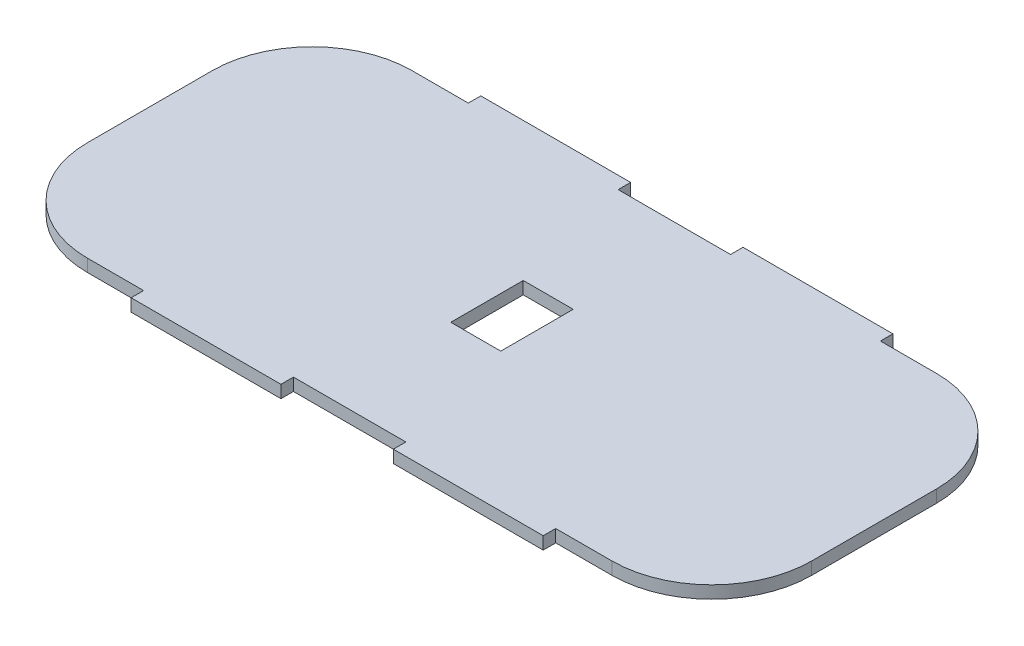
ISO-10303-21;
HEADER;
FILE_DESCRIPTION(('STEP AP214'),'2;1');
FILE_NAME('part.step','',(''),(''),'','','');
FILE_SCHEMA(('AUTOMOTIVE_DESIGN { 1 0 10303 214 1 1 1 1 }'));
ENDSEC;
DATA;
#1=APPLICATION_CONTEXT('core data for automotive mechanical design processes');
#2=APPLICATION_PROTOCOL_DEFINITION('international standard','automotive_design',2000,#1);
#3=PRODUCT_CONTEXT('',#1,'mechanical');
#4=PRODUCT('Part','Part','',(#3));
#5=PRODUCT_RELATED_PRODUCT_CATEGORY('part','',(#4));
#6=PRODUCT_DEFINITION_FORMATION('','',#4);
#7=PRODUCT_DEFINITION_CONTEXT('part definition',#1,'design');
#8=PRODUCT_DEFINITION('design','',#6,#7);
#9=PRODUCT_DEFINITION_SHAPE('','',#8);
#10=(LENGTH_UNIT() NAMED_UNIT(*) SI_UNIT(.MILLI.,.METRE.));
#11=(NAMED_UNIT(*) PLANE_ANGLE_UNIT() SI_UNIT($,.RADIAN.));
#12=(NAMED_UNIT(*) SI_UNIT($,.STERADIAN.) SOLID_ANGLE_UNIT());
#13=UNCERTAINTY_MEASURE_WITH_UNIT(LENGTH_MEASURE(1.E-05),#10,'distance_accuracy_value','');
#14=(GEOMETRIC_REPRESENTATION_CONTEXT(3) GLOBAL_UNCERTAINTY_ASSIGNED_CONTEXT((#13)) GLOBAL_UNIT_ASSIGNED_CONTEXT((#10,
#11,#12)) REPRESENTATION_CONTEXT('',''));
#15=CARTESIAN_POINT('',(0.,0.,0.));
#16=DIRECTION('',(0.,0.,1.));
#17=DIRECTION('',(1.,0.,0.));
#18=AXIS2_PLACEMENT_3D('',#15,#16,#17);
#19=CARTESIAN_POINT('',(52.5,2.5,-12.5));
#20=DIRECTION('',(0.,-1.,0.));
#21=DIRECTION('',(0.,0.,-1.));
#22=AXIS2_PLACEMENT_3D('',#19,#20,#21);
#23=CYLINDRICAL_SURFACE('',#22,20.);
#24=CARTESIAN_POINT('',(52.5,0.,-12.5));
#25=DIRECTION('',(0.,1.,0.));
#26=DIRECTION('',(0.,0.,-1.));
#27=AXIS2_PLACEMENT_3D('',#24,#25,#26);
#28=CIRCLE('',#27,20.);
#29=CARTESIAN_POINT('',(72.5,0.,-12.4999999999999));
#30=VERTEX_POINT('',#29);
#31=CARTESIAN_POINT('',(52.4999999999998,0.,-32.5));
#32=VERTEX_POINT('',#31);
#33=EDGE_CURVE('E274',#30,#32,#28,.T.);
#34=ORIENTED_EDGE('',*,*,#33,.T.);
#35=DIRECTION('',(0.,-1.,0.));
#36=VECTOR('',#35,1.);
#37=CARTESIAN_POINT('',(52.4999999999998,2.5,-32.5));
#38=LINE('',#37,#36);
#39=CARTESIAN_POINT('',(52.4999999999998,2.5,-32.5));
#40=VERTEX_POINT('',#39);
#41=EDGE_CURVE('E11',#40,#32,#38,.T.);
#42=ORIENTED_EDGE('',*,*,#41,.F.);
#43=CARTESIAN_POINT('',(52.5,2.5,-12.5));
#44=DIRECTION('',(0.,1.,0.));
#45=DIRECTION('',(0.,0.,-1.));
#46=AXIS2_PLACEMENT_3D('',#43,#44,#45);
#47=CIRCLE('',#46,20.);
#48=CARTESIAN_POINT('',(72.5,2.5,-12.4999999999999));
#49=VERTEX_POINT('',#48);
#50=EDGE_CURVE('E275',#49,#40,#47,.T.);
#51=ORIENTED_EDGE('',*,*,#50,.F.);
#52=DIRECTION('',(0.,-1.,0.));
#53=VECTOR('',#52,1.);
#54=CARTESIAN_POINT('',(72.5,2.5,-12.4999999999999));
#55=LINE('',#54,#53);
#56=EDGE_CURVE('E349',#49,#30,#55,.T.);
#57=ORIENTED_EDGE('',*,*,#56,.T.);
#58=EDGE_LOOP('',(#34,#42,#51,#57));
#59=FACE_BOUND('',#58,.T.);
#60=ADVANCED_FACE('F41',(#59),#23,.T.);
#61=CARTESIAN_POINT('',(41.2499999999997,2.5,-32.5));
#62=DIRECTION('',(0.,0.,1.));
#63=DIRECTION('',(1.,0.,0.));
#64=AXIS2_PLACEMENT_3D('',#61,#62,#63);
#65=PLANE('',#64);
#66=DIRECTION('',(-1.,0.,0.));
#67=VECTOR('',#66,1.);
#68=CARTESIAN_POINT('',(41.2499999999997,0.,-32.5));
#69=LINE('',#68,#67);
#70=CARTESIAN_POINT('',(41.2499999999997,0.,-32.5));
#71=VERTEX_POINT('',#70);
#72=EDGE_CURVE('E353',#32,#71,#69,.T.);
#73=ORIENTED_EDGE('',*,*,#72,.T.);
#74=DIRECTION('',(0.,-1.,0.));
#75=VECTOR('',#74,1.);
#76=CARTESIAN_POINT('',(41.2499999999997,2.5,-32.5));
#77=LINE('',#76,#75);
#78=CARTESIAN_POINT('',(41.2499999999997,2.5,-32.5));
#79=VERTEX_POINT('',#78);
#80=EDGE_CURVE('E49',#79,#71,#77,.T.);
#81=ORIENTED_EDGE('',*,*,#80,.F.);
#82=DIRECTION('',(-1.,0.,0.));
#83=VECTOR('',#82,1.);
#84=CARTESIAN_POINT('',(41.2499999999997,2.5,-32.5));
#85=LINE('',#84,#83);
#86=EDGE_CURVE('E279',#40,#79,#85,.T.);
#87=ORIENTED_EDGE('',*,*,#86,.F.);
#88=ORIENTED_EDGE('',*,*,#41,.T.);
#89=EDGE_LOOP('',(#73,#81,#87,#88));
#90=FACE_BOUND('',#89,.T.);
#91=ADVANCED_FACE('F534',(#90),#65,.F.);
#92=CARTESIAN_POINT('',(41.2499999999997,2.5,-35.0000000000003));
#93=DIRECTION('',(-1.,0.,0.));
#94=DIRECTION('',(0.,0.,1.));
#95=AXIS2_PLACEMENT_3D('',#92,#93,#94);
#96=PLANE('',#95);
#97=DIRECTION('',(0.,0.,-1.));
#98=VECTOR('',#97,1.);
#99=CARTESIAN_POINT('',(41.2499999999997,0.,-35.0000000000003));
#100=LINE('',#99,#98);
#101=CARTESIAN_POINT('',(41.2499999999997,0.,-35.0000000000003));
#102=VERTEX_POINT('',#101);
#103=EDGE_CURVE('E356',#71,#102,#100,.T.);
#104=ORIENTED_EDGE('',*,*,#103,.T.);
#105=DIRECTION('',(0.,-1.,0.));
#106=VECTOR('',#105,1.);
#107=CARTESIAN_POINT('',(41.2499999999997,2.5,-35.0000000000003));
#108=LINE('',#107,#106);
#109=CARTESIAN_POINT('',(41.2499999999997,2.5,-35.0000000000003));
#110=VERTEX_POINT('',#109);
#111=EDGE_CURVE('E504',#110,#102,#108,.T.);
#112=ORIENTED_EDGE('',*,*,#111,.F.);
#113=DIRECTION('',(0.,0.,-1.));
#114=VECTOR('',#113,1.);
#115=CARTESIAN_POINT('',(41.2499999999997,2.5,-35.0000000000003));
#116=LINE('',#115,#114);
#117=EDGE_CURVE('E283',#79,#110,#116,.T.);
#118=ORIENTED_EDGE('',*,*,#117,.F.);
#119=ORIENTED_EDGE('',*,*,#80,.T.);
#120=EDGE_LOOP('',(#104,#112,#118,#119));
#121=FACE_BOUND('',#120,.T.);
#122=ADVANCED_FACE('F513',(#121),#96,.F.);
#123=CARTESIAN_POINT('',(41.2499999999997,2.5,-35.0000000000003));
#124=DIRECTION('',(0.,0.,1.));
#125=DIRECTION('',(1.,0.,0.));
#126=AXIS2_PLACEMENT_3D('',#123,#124,#125);
#127=PLANE('',#126);
#128=DIRECTION('',(-1.,0.,0.));
#129=VECTOR('',#128,1.);
#130=CARTESIAN_POINT('',(41.2499999999997,0.,-35.0000000000003));
#131=LINE('',#130,#129);
#132=CARTESIAN_POINT('',(11.2499999999997,0.,-35.0000000000001));
#133=VERTEX_POINT('',#132);
#134=EDGE_CURVE('E359',#102,#133,#131,.T.);
#135=ORIENTED_EDGE('',*,*,#134,.T.);
#136=DIRECTION('',(0.,-1.,0.));
#137=VECTOR('',#136,1.);
#138=CARTESIAN_POINT('',(11.2499999999997,2.5,-35.0000000000001));
#139=LINE('',#138,#137);
#140=CARTESIAN_POINT('',(11.2499999999997,2.5,-35.0000000000001));
#141=VERTEX_POINT('',#140);
#142=EDGE_CURVE('E500',#141,#133,#139,.T.);
#143=ORIENTED_EDGE('',*,*,#142,.F.);
#144=DIRECTION('',(-1.,0.,0.));
#145=VECTOR('',#144,1.);
#146=CARTESIAN_POINT('',(41.2499999999997,2.5,-35.0000000000003));
#147=LINE('',#146,#145);
#148=EDGE_CURVE('E286',#110,#141,#147,.T.);
#149=ORIENTED_EDGE('',*,*,#148,.F.);
#150=ORIENTED_EDGE('',*,*,#111,.T.);
#151=EDGE_LOOP('',(#135,#143,#149,#150));
#152=FACE_BOUND('',#151,.T.);
#153=ADVANCED_FACE('F522',(#152),#127,.F.);
#154=CARTESIAN_POINT('',(11.2499999999997,2.5,-35.0000000000001));
#155=DIRECTION('',(1.,0.,0.));
#156=DIRECTION('',(0.,0.,-1.));
#157=AXIS2_PLACEMENT_3D('',#154,#155,#156);
#158=PLANE('',#157);
#159=DIRECTION('',(0.,0.,1.));
#160=VECTOR('',#159,1.);
#161=CARTESIAN_POINT('',(11.2499999999997,0.,-35.0000000000001));
#162=LINE('',#161,#160);
#163=CARTESIAN_POINT('',(11.2499999999997,0.,-32.5));
#164=VERTEX_POINT('',#163);
#165=EDGE_CURVE('E362',#133,#164,#162,.T.);
#166=ORIENTED_EDGE('',*,*,#165,.T.);
#167=DIRECTION('',(0.,-1.,0.));
#168=VECTOR('',#167,1.);
#169=CARTESIAN_POINT('',(11.2499999999997,2.5,-32.5));
#170=LINE('',#169,#168);
#171=CARTESIAN_POINT('',(11.2499999999997,2.5,-32.5));
#172=VERTEX_POINT('',#171);
#173=EDGE_CURVE('E496',#172,#164,#170,.T.);
#174=ORIENTED_EDGE('',*,*,#173,.F.);
#175=DIRECTION('',(0.,0.,1.));
#176=VECTOR('',#175,1.);
#177=CARTESIAN_POINT('',(11.2499999999997,2.5,-35.0000000000001));
#178=LINE('',#177,#176);
#179=EDGE_CURVE('E289',#141,#172,#178,.T.);
#180=ORIENTED_EDGE('',*,*,#179,.F.);
#181=ORIENTED_EDGE('',*,*,#142,.T.);
#182=EDGE_LOOP('',(#166,#174,#180,#181));
#183=FACE_BOUND('',#182,.T.);
#184=ADVANCED_FACE('F526',(#183),#158,.F.);
#185=CARTESIAN_POINT('',(-11.25,2.5,-32.5));
#186=DIRECTION('',(0.,0.,1.));
#187=DIRECTION('',(1.,0.,0.));
#188=AXIS2_PLACEMENT_3D('',#185,#186,#187);
#189=PLANE('',#188);
#190=DIRECTION('',(-1.,0.,0.));
#191=VECTOR('',#190,1.);
#192=CARTESIAN_POINT('',(-11.25,0.,-32.5));
#193=LINE('',#192,#191);
#194=CARTESIAN_POINT('',(-11.25,0.,-32.5));
#195=VERTEX_POINT('',#194);
#196=EDGE_CURVE('E365',#164,#195,#193,.T.);
#197=ORIENTED_EDGE('',*,*,#196,.T.);
#198=DIRECTION('',(0.,-1.,0.));
#199=VECTOR('',#198,1.);
#200=CARTESIAN_POINT('',(-11.25,2.5,-32.5));
#201=LINE('',#200,#199);
#202=CARTESIAN_POINT('',(-11.25,2.5,-32.5));
#203=VERTEX_POINT('',#202);
#204=EDGE_CURVE('E492',#203,#195,#201,.T.);
#205=ORIENTED_EDGE('',*,*,#204,.F.);
#206=DIRECTION('',(-1.,0.,0.));
#207=VECTOR('',#206,1.);
#208=CARTESIAN_POINT('',(-11.25,2.5,-32.5));
#209=LINE('',#208,#207);
#210=EDGE_CURVE('E292',#172,#203,#209,.T.);
#211=ORIENTED_EDGE('',*,*,#210,.F.);
#212=ORIENTED_EDGE('',*,*,#173,.T.);
#213=EDGE_LOOP('',(#197,#205,#211,#212));
#214=FACE_BOUND('',#213,.T.);
#215=ADVANCED_FACE('F627',(#214),#189,.F.);
#216=CARTESIAN_POINT('',(-11.25,2.5,-35.));
#217=DIRECTION('',(-1.,0.,0.));
#218=DIRECTION('',(0.,0.,1.));
#219=AXIS2_PLACEMENT_3D('',#216,#217,#218);
#220=PLANE('',#219);
#221=DIRECTION('',(0.,0.,-1.));
#222=VECTOR('',#221,1.);
#223=CARTESIAN_POINT('',(-11.25,0.,-35.));
#224=LINE('',#223,#222);
#225=CARTESIAN_POINT('',(-11.25,0.,-35.));
#226=VERTEX_POINT('',#225);
#227=EDGE_CURVE('E368',#195,#226,#224,.T.);
#228=ORIENTED_EDGE('',*,*,#227,.T.);
#229=DIRECTION('',(0.,-1.,0.));
#230=VECTOR('',#229,1.);
#231=CARTESIAN_POINT('',(-11.25,2.5,-35.));
#232=LINE('',#231,#230);
#233=CARTESIAN_POINT('',(-11.25,2.5,-35.));
#234=VERTEX_POINT('',#233);
#235=EDGE_CURVE('E488',#234,#226,#232,.T.);
#236=ORIENTED_EDGE('',*,*,#235,.F.);
#237=DIRECTION('',(0.,0.,-1.));
#238=VECTOR('',#237,1.);
#239=CARTESIAN_POINT('',(-11.25,2.5,-35.));
#240=LINE('',#239,#238);
#241=EDGE_CURVE('E295',#203,#234,#240,.T.);
#242=ORIENTED_EDGE('',*,*,#241,.F.);
#243=ORIENTED_EDGE('',*,*,#204,.T.);
#244=EDGE_LOOP('',(#228,#236,#242,#243));
#245=FACE_BOUND('',#244,.T.);
#246=ADVANCED_FACE('F625',(#245),#220,.F.);
#247=CARTESIAN_POINT('',(-41.25,2.5,-35.));
#248=DIRECTION('',(0.,0.,1.));
#249=DIRECTION('',(1.,0.,0.));
#250=AXIS2_PLACEMENT_3D('',#247,#248,#249);
#251=PLANE('',#250);
#252=DIRECTION('',(-1.,0.,0.));
#253=VECTOR('',#252,1.);
#254=CARTESIAN_POINT('',(-41.25,0.,-35.));
#255=LINE('',#254,#253);
#256=CARTESIAN_POINT('',(-41.25,0.,-35.));
#257=VERTEX_POINT('',#256);
#258=EDGE_CURVE('E371',#226,#257,#255,.T.);
#259=ORIENTED_EDGE('',*,*,#258,.T.);
#260=DIRECTION('',(0.,-1.,0.));
#261=VECTOR('',#260,1.);
#262=CARTESIAN_POINT('',(-41.25,2.5,-35.));
#263=LINE('',#262,#261);
#264=CARTESIAN_POINT('',(-41.25,2.5,-35.));
#265=VERTEX_POINT('',#264);
#266=EDGE_CURVE('E484',#265,#257,#263,.T.);
#267=ORIENTED_EDGE('',*,*,#266,.F.);
#268=DIRECTION('',(-1.,0.,0.));
#269=VECTOR('',#268,1.);
#270=CARTESIAN_POINT('',(-41.25,2.5,-35.));
#271=LINE('',#270,#269);
#272=EDGE_CURVE('E298',#234,#265,#271,.T.);
#273=ORIENTED_EDGE('',*,*,#272,.F.);
#274=ORIENTED_EDGE('',*,*,#235,.T.);
#275=EDGE_LOOP('',(#259,#267,#273,#274));
#276=FACE_BOUND('',#275,.T.);
#277=ADVANCED_FACE('F621',(#276),#251,.F.);
#278=CARTESIAN_POINT('',(-41.25,2.5,-35.));
#279=DIRECTION('',(1.,0.,0.));
#280=DIRECTION('',(0.,0.,-1.));
#281=AXIS2_PLACEMENT_3D('',#278,#279,#280);
#282=PLANE('',#281);
#283=DIRECTION('',(0.,0.,1.));
#284=VECTOR('',#283,1.);
#285=CARTESIAN_POINT('',(-41.25,0.,-35.));
#286=LINE('',#285,#284);
#287=CARTESIAN_POINT('',(-41.25,0.,-32.5));
#288=VERTEX_POINT('',#287);
#289=EDGE_CURVE('E374',#257,#288,#286,.T.);
#290=ORIENTED_EDGE('',*,*,#289,.T.);
#291=DIRECTION('',(0.,-1.,0.));
#292=VECTOR('',#291,1.);
#293=CARTESIAN_POINT('',(-41.25,2.5,-32.5));
#294=LINE('',#293,#292);
#295=CARTESIAN_POINT('',(-41.25,2.5,-32.5));
#296=VERTEX_POINT('',#295);
#297=EDGE_CURVE('E480',#296,#288,#294,.T.);
#298=ORIENTED_EDGE('',*,*,#297,.F.);
#299=DIRECTION('',(0.,0.,1.));
#300=VECTOR('',#299,1.);
#301=CARTESIAN_POINT('',(-41.25,2.5,-35.));
#302=LINE('',#301,#300);
#303=EDGE_CURVE('E301',#265,#296,#302,.T.);
#304=ORIENTED_EDGE('',*,*,#303,.F.);
#305=ORIENTED_EDGE('',*,*,#266,.T.);
#306=EDGE_LOOP('',(#290,#298,#304,#305));
#307=FACE_BOUND('',#306,.T.);
#308=ADVANCED_FACE('F616',(#307),#282,.F.);
#309=CARTESIAN_POINT('',(-52.4999999999999,2.5,-32.5));
#310=DIRECTION('',(0.,0.,1.));
#311=DIRECTION('',(1.,0.,0.));
#312=AXIS2_PLACEMENT_3D('',#309,#310,#311);
#313=PLANE('',#312);
#314=DIRECTION('',(-1.,0.,0.));
#315=VECTOR('',#314,1.);
#316=CARTESIAN_POINT('',(-52.4999999999999,0.,-32.5));
#317=LINE('',#316,#315);
#318=CARTESIAN_POINT('',(-52.4999999999999,0.,-32.5));
#319=VERTEX_POINT('',#318);
#320=EDGE_CURVE('E377',#288,#319,#317,.T.);
#321=ORIENTED_EDGE('',*,*,#320,.T.);
#322=DIRECTION('',(0.,-1.,0.));
#323=VECTOR('',#322,1.);
#324=CARTESIAN_POINT('',(-52.4999999999999,2.5,-32.5));
#325=LINE('',#324,#323);
#326=CARTESIAN_POINT('',(-52.4999999999999,2.5,-32.5));
#327=VERTEX_POINT('',#326);
#328=EDGE_CURVE('E476',#327,#319,#325,.T.);
#329=ORIENTED_EDGE('',*,*,#328,.F.);
#330=DIRECTION('',(-1.,0.,0.));
#331=VECTOR('',#330,1.);
#332=CARTESIAN_POINT('',(-52.4999999999999,2.5,-32.5));
#333=LINE('',#332,#331);
#334=EDGE_CURVE('E304',#296,#327,#333,.T.);
#335=ORIENTED_EDGE('',*,*,#334,.F.);
#336=ORIENTED_EDGE('',*,*,#297,.T.);
#337=EDGE_LOOP('',(#321,#329,#335,#336));
#338=FACE_BOUND('',#337,.T.);
#339=ADVANCED_FACE('F610',(#338),#313,.F.);
#340=CARTESIAN_POINT('',(-52.5,2.5,-12.5));
#341=DIRECTION('',(0.,-1.,0.));
#342=DIRECTION('',(0.,0.,-1.));
#343=AXIS2_PLACEMENT_3D('',#340,#341,#342);
#344=CYLINDRICAL_SURFACE('',#343,20.);
#345=CARTESIAN_POINT('',(-52.5,0.,-12.5));
#346=DIRECTION('',(0.,1.,0.));
#347=DIRECTION('',(0.,0.,-1.));
#348=AXIS2_PLACEMENT_3D('',#345,#346,#347);
#349=CIRCLE('',#348,20.);
#350=CARTESIAN_POINT('',(-72.5,0.,-12.4999999999999));
#351=VERTEX_POINT('',#350);
#352=EDGE_CURVE('E380',#319,#351,#349,.T.);
#353=ORIENTED_EDGE('',*,*,#352,.T.);
#354=DIRECTION('',(0.,-1.,0.));
#355=VECTOR('',#354,1.);
#356=CARTESIAN_POINT('',(-72.5,2.5,-12.4999999999999));
#357=LINE('',#356,#355);
#358=CARTESIAN_POINT('',(-72.5,2.5,-12.4999999999999));
#359=VERTEX_POINT('',#358);
#360=EDGE_CURVE('E472',#359,#351,#357,.T.);
#361=ORIENTED_EDGE('',*,*,#360,.F.);
#362=CARTESIAN_POINT('',(-52.5,2.5,-12.5));
#363=DIRECTION('',(0.,1.,0.));
#364=DIRECTION('',(0.,0.,-1.));
#365=AXIS2_PLACEMENT_3D('',#362,#363,#364);
#366=CIRCLE('',#365,20.);
#367=EDGE_CURVE('E307',#327,#359,#366,.T.);
#368=ORIENTED_EDGE('',*,*,#367,.F.);
#369=ORIENTED_EDGE('',*,*,#328,.T.);
#370=EDGE_LOOP('',(#353,#361,#368,#369));
#371=FACE_BOUND('',#370,.T.);
#372=ADVANCED_FACE('F606',(#371),#344,.T.);
#373=CARTESIAN_POINT('',(-72.5,2.5,-12.4999999999999));
#374=DIRECTION('',(1.,0.,0.));
#375=DIRECTION('',(0.,0.,-1.));
#376=AXIS2_PLACEMENT_3D('',#373,#374,#375);
#377=PLANE('',#376);
#378=DIRECTION('',(0.,0.,1.));
#379=VECTOR('',#378,1.);
#380=CARTESIAN_POINT('',(-72.5,0.,-12.4999999999999));
#381=LINE('',#380,#379);
#382=CARTESIAN_POINT('',(-72.5,0.,12.4999999999999));
#383=VERTEX_POINT('',#382);
#384=EDGE_CURVE('E383',#351,#383,#381,.T.);
#385=ORIENTED_EDGE('',*,*,#384,.T.);
#386=DIRECTION('',(0.,-1.,0.));
#387=VECTOR('',#386,1.);
#388=CARTESIAN_POINT('',(-72.5,2.5,12.4999999999999));
#389=LINE('',#388,#387);
#390=CARTESIAN_POINT('',(-72.5,2.5,12.4999999999999));
#391=VERTEX_POINT('',#390);
#392=EDGE_CURVE('E468',#391,#383,#389,.T.);
#393=ORIENTED_EDGE('',*,*,#392,.F.);
#394=DIRECTION('',(0.,0.,1.));
#395=VECTOR('',#394,1.);
#396=CARTESIAN_POINT('',(-72.5,2.5,-12.4999999999999));
#397=LINE('',#396,#395);
#398=EDGE_CURVE('E310',#359,#391,#397,.T.);
#399=ORIENTED_EDGE('',*,*,#398,.F.);
#400=ORIENTED_EDGE('',*,*,#360,.T.);
#401=EDGE_LOOP('',(#385,#393,#399,#400));
#402=FACE_BOUND('',#401,.T.);
#403=ADVANCED_FACE('F601',(#402),#377,.F.);
#404=CARTESIAN_POINT('',(-52.5,2.5,12.5));
#405=DIRECTION('',(0.,-1.,0.));
#406=DIRECTION('',(0.,0.,-1.));
#407=AXIS2_PLACEMENT_3D('',#404,#405,#406);
#408=CYLINDRICAL_SURFACE('',#407,20.);
#409=CARTESIAN_POINT('',(-52.5,0.,12.5));
#410=DIRECTION('',(0.,1.,0.));
#411=DIRECTION('',(0.,0.,-1.));
#412=AXIS2_PLACEMENT_3D('',#409,#410,#411);
#413=CIRCLE('',#412,20.);
#414=CARTESIAN_POINT('',(-52.4999999999999,0.,32.5));
#415=VERTEX_POINT('',#414);
#416=EDGE_CURVE('E386',#383,#415,#413,.T.);
#417=ORIENTED_EDGE('',*,*,#416,.T.);
#418=DIRECTION('',(0.,-1.,0.));
#419=VECTOR('',#418,1.);
#420=CARTESIAN_POINT('',(-52.4999999999999,2.5,32.5));
#421=LINE('',#420,#419);
#422=CARTESIAN_POINT('',(-52.4999999999999,2.5,32.5));
#423=VERTEX_POINT('',#422);
#424=EDGE_CURVE('E464',#423,#415,#421,.T.);
#425=ORIENTED_EDGE('',*,*,#424,.F.);
#426=CARTESIAN_POINT('',(-52.5,2.5,12.5));
#427=DIRECTION('',(0.,1.,0.));
#428=DIRECTION('',(0.,0.,-1.));
#429=AXIS2_PLACEMENT_3D('',#426,#427,#428);
#430=CIRCLE('',#429,20.);
#431=EDGE_CURVE('E313',#391,#423,#430,.T.);
#432=ORIENTED_EDGE('',*,*,#431,.F.);
#433=ORIENTED_EDGE('',*,*,#392,.T.);
#434=EDGE_LOOP('',(#417,#425,#432,#433));
#435=FACE_BOUND('',#434,.T.);
#436=ADVANCED_FACE('F595',(#435),#408,.T.);
#437=CARTESIAN_POINT('',(-52.4999999999999,2.5,32.5));
#438=DIRECTION('',(0.,0.,-1.));
#439=DIRECTION('',(-1.,0.,0.));
#440=AXIS2_PLACEMENT_3D('',#437,#438,#439);
#441=PLANE('',#440);
#442=DIRECTION('',(1.,0.,0.));
#443=VECTOR('',#442,1.);
#444=CARTESIAN_POINT('',(-52.4999999999999,0.,32.5));
#445=LINE('',#444,#443);
#446=CARTESIAN_POINT('',(-41.25,0.,32.5));
#447=VERTEX_POINT('',#446);
#448=EDGE_CURVE('E389',#415,#447,#445,.T.);
#449=ORIENTED_EDGE('',*,*,#448,.T.);
#450=DIRECTION('',(0.,-1.,0.));
#451=VECTOR('',#450,1.);
#452=CARTESIAN_POINT('',(-41.25,2.5,32.5));
#453=LINE('',#452,#451);
#454=CARTESIAN_POINT('',(-41.25,2.5,32.5));
#455=VERTEX_POINT('',#454);
#456=EDGE_CURVE('E460',#455,#447,#453,.T.);
#457=ORIENTED_EDGE('',*,*,#456,.F.);
#458=DIRECTION('',(1.,0.,0.));
#459=VECTOR('',#458,1.);
#460=CARTESIAN_POINT('',(-52.4999999999999,2.5,32.5));
#461=LINE('',#460,#459);
#462=EDGE_CURVE('E316',#423,#455,#461,.T.);
#463=ORIENTED_EDGE('',*,*,#462,.F.);
#464=ORIENTED_EDGE('',*,*,#424,.T.);
#465=EDGE_LOOP('',(#449,#457,#463,#464));
#466=FACE_BOUND('',#465,.T.);
#467=ADVANCED_FACE('F591',(#466),#441,.F.);
#468=CARTESIAN_POINT('',(-41.25,2.5,35.));
#469=DIRECTION('',(1.,0.,0.));
#470=DIRECTION('',(0.,0.,-1.));
#471=AXIS2_PLACEMENT_3D('',#468,#469,#470);
#472=PLANE('',#471);
#473=DIRECTION('',(0.,0.,1.));
#474=VECTOR('',#473,1.);
#475=CARTESIAN_POINT('',(-41.25,0.,35.));
#476=LINE('',#475,#474);
#477=CARTESIAN_POINT('',(-41.25,0.,35.));
#478=VERTEX_POINT('',#477);
#479=EDGE_CURVE('E392',#447,#478,#476,.T.);
#480=ORIENTED_EDGE('',*,*,#479,.T.);
#481=DIRECTION('',(0.,-1.,0.));
#482=VECTOR('',#481,1.);
#483=CARTESIAN_POINT('',(-41.25,2.5,35.));
#484=LINE('',#483,#482);
#485=CARTESIAN_POINT('',(-41.25,2.5,35.));
#486=VERTEX_POINT('',#485);
#487=EDGE_CURVE('E456',#486,#478,#484,.T.);
#488=ORIENTED_EDGE('',*,*,#487,.F.);
#489=DIRECTION('',(0.,0.,1.));
#490=VECTOR('',#489,1.);
#491=CARTESIAN_POINT('',(-41.25,2.5,35.));
#492=LINE('',#491,#490);
#493=EDGE_CURVE('E319',#455,#486,#492,.T.);
#494=ORIENTED_EDGE('',*,*,#493,.F.);
#495=ORIENTED_EDGE('',*,*,#456,.T.);
#496=EDGE_LOOP('',(#480,#488,#494,#495));
#497=FACE_BOUND('',#496,.T.);
#498=ADVANCED_FACE('F586',(#497),#472,.F.);
#499=CARTESIAN_POINT('',(-41.25,2.5,35.));
#500=DIRECTION('',(0.,0.,-1.));
#501=DIRECTION('',(-1.,0.,0.));
#502=AXIS2_PLACEMENT_3D('',#499,#500,#501);
#503=PLANE('',#502);
#504=DIRECTION('',(1.,0.,0.));
#505=VECTOR('',#504,1.);
#506=CARTESIAN_POINT('',(-41.25,0.,35.));
#507=LINE('',#506,#505);
#508=CARTESIAN_POINT('',(-11.25,0.,35.));
#509=VERTEX_POINT('',#508);
#510=EDGE_CURVE('E395',#478,#509,#507,.T.);
#511=ORIENTED_EDGE('',*,*,#510,.T.);
#512=DIRECTION('',(0.,-1.,0.));
#513=VECTOR('',#512,1.);
#514=CARTESIAN_POINT('',(-11.25,2.5,35.));
#515=LINE('',#514,#513);
#516=CARTESIAN_POINT('',(-11.25,2.5,35.));
#517=VERTEX_POINT('',#516);
#518=EDGE_CURVE('E452',#517,#509,#515,.T.);
#519=ORIENTED_EDGE('',*,*,#518,.F.);
#520=DIRECTION('',(1.,0.,0.));
#521=VECTOR('',#520,1.);
#522=CARTESIAN_POINT('',(-41.25,2.5,35.));
#523=LINE('',#522,#521);
#524=EDGE_CURVE('E322',#486,#517,#523,.T.);
#525=ORIENTED_EDGE('',*,*,#524,.F.);
#526=ORIENTED_EDGE('',*,*,#487,.T.);
#527=EDGE_LOOP('',(#511,#519,#525,#526));
#528=FACE_BOUND('',#527,.T.);
#529=ADVANCED_FACE('F580',(#528),#503,.F.);
#530=CARTESIAN_POINT('',(-11.25,2.5,35.));
#531=DIRECTION('',(-1.,0.,0.));
#532=DIRECTION('',(0.,0.,1.));
#533=AXIS2_PLACEMENT_3D('',#530,#531,#532);
#534=PLANE('',#533);
#535=DIRECTION('',(0.,0.,-1.));
#536=VECTOR('',#535,1.);
#537=CARTESIAN_POINT('',(-11.25,0.,35.));
#538=LINE('',#537,#536);
#539=CARTESIAN_POINT('',(-11.25,0.,32.5));
#540=VERTEX_POINT('',#539);
#541=EDGE_CURVE('E398',#509,#540,#538,.T.);
#542=ORIENTED_EDGE('',*,*,#541,.T.);
#543=DIRECTION('',(0.,-1.,0.));
#544=VECTOR('',#543,1.);
#545=CARTESIAN_POINT('',(-11.25,2.5,32.5));
#546=LINE('',#545,#544);
#547=CARTESIAN_POINT('',(-11.25,2.5,32.5));
#548=VERTEX_POINT('',#547);
#549=EDGE_CURVE('E448',#548,#540,#546,.T.);
#550=ORIENTED_EDGE('',*,*,#549,.F.);
#551=DIRECTION('',(0.,0.,-1.));
#552=VECTOR('',#551,1.);
#553=CARTESIAN_POINT('',(-11.25,2.5,35.));
#554=LINE('',#553,#552);
#555=EDGE_CURVE('E325',#517,#548,#554,.T.);
#556=ORIENTED_EDGE('',*,*,#555,.F.);
#557=ORIENTED_EDGE('',*,*,#518,.T.);
#558=EDGE_LOOP('',(#542,#550,#556,#557));
#559=FACE_BOUND('',#558,.T.);
#560=ADVANCED_FACE('F576',(#559),#534,.F.);
#561=CARTESIAN_POINT('',(-11.25,2.5,32.5));
#562=DIRECTION('',(0.,0.,-1.));
#563=DIRECTION('',(-1.,0.,0.));
#564=AXIS2_PLACEMENT_3D('',#561,#562,#563);
#565=PLANE('',#564);
#566=DIRECTION('',(1.,0.,0.));
#567=VECTOR('',#566,1.);
#568=CARTESIAN_POINT('',(-11.25,0.,32.5));
#569=LINE('',#568,#567);
#570=CARTESIAN_POINT('',(11.2500000000002,0.,32.5));
#571=VERTEX_POINT('',#570);
#572=EDGE_CURVE('E401',#540,#571,#569,.T.);
#573=ORIENTED_EDGE('',*,*,#572,.T.);
#574=DIRECTION('',(0.,-1.,0.));
#575=VECTOR('',#574,1.);
#576=CARTESIAN_POINT('',(11.2500000000002,2.5,32.5));
#577=LINE('',#576,#575);
#578=CARTESIAN_POINT('',(11.2500000000002,2.5,32.5));
#579=VERTEX_POINT('',#578);
#580=EDGE_CURVE('E444',#579,#571,#577,.T.);
#581=ORIENTED_EDGE('',*,*,#580,.F.);
#582=DIRECTION('',(1.,0.,0.));
#583=VECTOR('',#582,1.);
#584=CARTESIAN_POINT('',(-11.25,2.5,32.5));
#585=LINE('',#584,#583);
#586=EDGE_CURVE('E328',#548,#579,#585,.T.);
#587=ORIENTED_EDGE('',*,*,#586,.F.);
#588=ORIENTED_EDGE('',*,*,#549,.T.);
#589=EDGE_LOOP('',(#573,#581,#587,#588));
#590=FACE_BOUND('',#589,.T.);
#591=ADVANCED_FACE('F571',(#590),#565,.F.);
#592=CARTESIAN_POINT('',(11.2500000000002,2.5,34.9999999999999));
#593=DIRECTION('',(1.,0.,0.));
#594=DIRECTION('',(0.,0.,-1.));
#595=AXIS2_PLACEMENT_3D('',#592,#593,#594);
#596=PLANE('',#595);
#597=DIRECTION('',(0.,0.,1.));
#598=VECTOR('',#597,1.);
#599=CARTESIAN_POINT('',(11.2500000000002,0.,34.9999999999999));
#600=LINE('',#599,#598);
#601=CARTESIAN_POINT('',(11.2500000000002,0.,34.9999999999999));
#602=VERTEX_POINT('',#601);
#603=EDGE_CURVE('E404',#571,#602,#600,.T.);
#604=ORIENTED_EDGE('',*,*,#603,.T.);
#605=DIRECTION('',(0.,-1.,0.));
#606=VECTOR('',#605,1.);
#607=CARTESIAN_POINT('',(11.2500000000002,2.5,34.9999999999999));
#608=LINE('',#607,#606);
#609=CARTESIAN_POINT('',(11.2500000000002,2.5,34.9999999999999));
#610=VERTEX_POINT('',#609);
#611=EDGE_CURVE('E440',#610,#602,#608,.T.);
#612=ORIENTED_EDGE('',*,*,#611,.F.);
#613=DIRECTION('',(0.,0.,1.));
#614=VECTOR('',#613,1.);
#615=CARTESIAN_POINT('',(11.2500000000002,2.5,34.9999999999999));
#616=LINE('',#615,#614);
#617=EDGE_CURVE('E331',#579,#610,#616,.T.);
#618=ORIENTED_EDGE('',*,*,#617,.F.);
#619=ORIENTED_EDGE('',*,*,#580,.T.);
#620=EDGE_LOOP('',(#604,#612,#618,#619));
#621=FACE_BOUND('',#620,.T.);
#622=ADVANCED_FACE('F565',(#621),#596,.F.);
#623=CARTESIAN_POINT('',(41.2500000000002,2.5,34.9999999999997));
#624=DIRECTION('',(0.,0.,-1.));
#625=DIRECTION('',(-1.,0.,0.));
#626=AXIS2_PLACEMENT_3D('',#623,#624,#625);
#627=PLANE('',#626);
#628=DIRECTION('',(1.,0.,0.));
#629=VECTOR('',#628,1.);
#630=CARTESIAN_POINT('',(41.2500000000002,0.,34.9999999999997));
#631=LINE('',#630,#629);
#632=CARTESIAN_POINT('',(41.2500000000002,0.,34.9999999999997));
#633=VERTEX_POINT('',#632);
#634=EDGE_CURVE('E407',#602,#633,#631,.T.);
#635=ORIENTED_EDGE('',*,*,#634,.T.);
#636=DIRECTION('',(0.,-1.,0.));
#637=VECTOR('',#636,1.);
#638=CARTESIAN_POINT('',(41.2500000000002,2.5,34.9999999999997));
#639=LINE('',#638,#637);
#640=CARTESIAN_POINT('',(41.2500000000002,2.5,34.9999999999997));
#641=VERTEX_POINT('',#640);
#642=EDGE_CURVE('E436',#641,#633,#639,.T.);
#643=ORIENTED_EDGE('',*,*,#642,.F.);
#644=DIRECTION('',(1.,0.,0.));
#645=VECTOR('',#644,1.);
#646=CARTESIAN_POINT('',(41.2500000000002,2.5,34.9999999999997));
#647=LINE('',#646,#645);
#648=EDGE_CURVE('E334',#610,#641,#647,.T.);
#649=ORIENTED_EDGE('',*,*,#648,.F.);
#650=ORIENTED_EDGE('',*,*,#611,.T.);
#651=EDGE_LOOP('',(#635,#643,#649,#650));
#652=FACE_BOUND('',#651,.T.);
#653=ADVANCED_FACE('F561',(#652),#627,.F.);
#654=CARTESIAN_POINT('',(41.2500000000002,2.5,34.9999999999997));
#655=DIRECTION('',(-1.,0.,0.));
#656=DIRECTION('',(0.,0.,1.));
#657=AXIS2_PLACEMENT_3D('',#654,#655,#656);
#658=PLANE('',#657);
#659=DIRECTION('',(0.,0.,-1.));
#660=VECTOR('',#659,1.);
#661=CARTESIAN_POINT('',(41.2500000000002,0.,34.9999999999997));
#662=LINE('',#661,#660);
#663=CARTESIAN_POINT('',(41.2500000000002,0.,32.5));
#664=VERTEX_POINT('',#663);
#665=EDGE_CURVE('E410',#633,#664,#662,.T.);
#666=ORIENTED_EDGE('',*,*,#665,.T.);
#667=DIRECTION('',(0.,-1.,0.));
#668=VECTOR('',#667,1.);
#669=CARTESIAN_POINT('',(41.2500000000002,2.5,32.5));
#670=LINE('',#669,#668);
#671=CARTESIAN_POINT('',(41.2500000000002,2.5,32.5));
#672=VERTEX_POINT('',#671);
#673=EDGE_CURVE('E432',#672,#664,#670,.T.);
#674=ORIENTED_EDGE('',*,*,#673,.F.);
#675=DIRECTION('',(0.,0.,-1.));
#676=VECTOR('',#675,1.);
#677=CARTESIAN_POINT('',(41.2500000000002,2.5,34.9999999999997));
#678=LINE('',#677,#676);
#679=EDGE_CURVE('E337',#641,#672,#678,.T.);
#680=ORIENTED_EDGE('',*,*,#679,.F.);
#681=ORIENTED_EDGE('',*,*,#642,.T.);
#682=EDGE_LOOP('',(#666,#674,#680,#681));
#683=FACE_BOUND('',#682,.T.);
#684=ADVANCED_FACE('F556',(#683),#658,.F.);
#685=CARTESIAN_POINT('',(41.2500000000002,2.5,32.5));
#686=DIRECTION('',(0.,0.,-1.));
#687=DIRECTION('',(-1.,0.,0.));
#688=AXIS2_PLACEMENT_3D('',#685,#686,#687);
#689=PLANE('',#688);
#690=DIRECTION('',(1.,0.,0.));
#691=VECTOR('',#690,1.);
#692=CARTESIAN_POINT('',(41.2500000000002,0.,32.5));
#693=LINE('',#692,#691);
#694=CARTESIAN_POINT('',(52.4999999999998,0.,32.5));
#695=VERTEX_POINT('',#694);
#696=EDGE_CURVE('E413',#664,#695,#693,.T.);
#697=ORIENTED_EDGE('',*,*,#696,.T.);
#698=DIRECTION('',(0.,-1.,0.));
#699=VECTOR('',#698,1.);
#700=CARTESIAN_POINT('',(52.4999999999998,2.5,32.5));
#701=LINE('',#700,#699);
#702=CARTESIAN_POINT('',(52.4999999999998,2.5,32.5));
#703=VERTEX_POINT('',#702);
#704=EDGE_CURVE('E428',#703,#695,#701,.T.);
#705=ORIENTED_EDGE('',*,*,#704,.F.);
#706=DIRECTION('',(1.,0.,0.));
#707=VECTOR('',#706,1.);
#708=CARTESIAN_POINT('',(41.2500000000002,2.5,32.5));
#709=LINE('',#708,#707);
#710=EDGE_CURVE('E340',#672,#703,#709,.T.);
#711=ORIENTED_EDGE('',*,*,#710,.F.);
#712=ORIENTED_EDGE('',*,*,#673,.T.);
#713=EDGE_LOOP('',(#697,#705,#711,#712));
#714=FACE_BOUND('',#713,.T.);
#715=ADVANCED_FACE('F550',(#714),#689,.F.);
#716=CARTESIAN_POINT('',(52.5,2.5,12.5));
#717=DIRECTION('',(0.,-1.,0.));
#718=DIRECTION('',(0.,0.,-1.));
#719=AXIS2_PLACEMENT_3D('',#716,#717,#718);
#720=CYLINDRICAL_SURFACE('',#719,20.);
#721=CARTESIAN_POINT('',(52.5,0.,12.5));
#722=DIRECTION('',(0.,1.,0.));
#723=DIRECTION('',(0.,0.,-1.));
#724=AXIS2_PLACEMENT_3D('',#721,#722,#723);
#725=CIRCLE('',#724,20.);
#726=CARTESIAN_POINT('',(72.5,0.,12.4999999999999));
#727=VERTEX_POINT('',#726);
#728=EDGE_CURVE('E416',#695,#727,#725,.T.);
#729=ORIENTED_EDGE('',*,*,#728,.T.);
#730=DIRECTION('',(0.,-1.,0.));
#731=VECTOR('',#730,1.);
#732=CARTESIAN_POINT('',(72.5,2.5,12.4999999999999));
#733=LINE('',#732,#731);
#734=CARTESIAN_POINT('',(72.5,2.5,12.4999999999999));
#735=VERTEX_POINT('',#734);
#736=EDGE_CURVE('E424',#735,#727,#733,.T.);
#737=ORIENTED_EDGE('',*,*,#736,.F.);
#738=CARTESIAN_POINT('',(52.5,2.5,12.5));
#739=DIRECTION('',(0.,1.,0.));
#740=DIRECTION('',(0.,0.,-1.));
#741=AXIS2_PLACEMENT_3D('',#738,#739,#740);
#742=CIRCLE('',#741,20.);
#743=EDGE_CURVE('E343',#703,#735,#742,.T.);
#744=ORIENTED_EDGE('',*,*,#743,.F.);
#745=ORIENTED_EDGE('',*,*,#704,.T.);
#746=EDGE_LOOP('',(#729,#737,#744,#745));
#747=FACE_BOUND('',#746,.T.);
#748=ADVANCED_FACE('F546',(#747),#720,.T.);
#749=CARTESIAN_POINT('',(72.5,2.5,-12.4999999999999));
#750=DIRECTION('',(-1.,0.,0.));
#751=DIRECTION('',(0.,0.,1.));
#752=AXIS2_PLACEMENT_3D('',#749,#750,#751);
#753=PLANE('',#752);
#754=DIRECTION('',(0.,0.,-1.));
#755=VECTOR('',#754,1.);
#756=CARTESIAN_POINT('',(72.5,0.,-12.4999999999999));
#757=LINE('',#756,#755);
#758=EDGE_CURVE('E280',#727,#30,#757,.T.);
#759=ORIENTED_EDGE('',*,*,#758,.T.);
#760=ORIENTED_EDGE('',*,*,#56,.F.);
#761=DIRECTION('',(0.,0.,-1.));
#762=VECTOR('',#761,1.);
#763=CARTESIAN_POINT('',(72.5,2.5,-12.4999999999999));
#764=LINE('',#763,#762);
#765=EDGE_CURVE('E346',#735,#49,#764,.T.);
#766=ORIENTED_EDGE('',*,*,#765,.F.);
#767=ORIENTED_EDGE('',*,*,#736,.T.);
#768=EDGE_LOOP('',(#759,#760,#766,#767));
#769=FACE_BOUND('',#768,.T.);
#770=ADVANCED_FACE('F541',(#769),#753,.F.);
#771=CARTESIAN_POINT('',(52.5,2.5,-12.5));
#772=DIRECTION('',(0.,-1.,0.));
#773=DIRECTION('',(0.,0.,-1.));
#774=AXIS2_PLACEMENT_3D('',#771,#772,#773);
#775=PLANE('',#774);
#776=DIRECTION('',(1.,0.,0.));
#777=VECTOR('',#776,1.);
#778=CARTESIAN_POINT('',(52.5,2.5,-7.25));
#779=LINE('',#778,#777);
#780=CARTESIAN_POINT('',(-5.,2.5,-7.25));
#781=VERTEX_POINT('',#780);
#782=CARTESIAN_POINT('',(5.,2.5,-7.25));
#783=VERTEX_POINT('',#782);
#784=EDGE_CURVE('E266',#781,#783,#779,.T.);
#785=ORIENTED_EDGE('',*,*,#784,.T.);
#786=DIRECTION('',(0.,0.,1.));
#787=VECTOR('',#786,1.);
#788=CARTESIAN_POINT('',(5.,2.5,-12.5));
#789=LINE('',#788,#787);
#790=CARTESIAN_POINT('',(5.,2.5,7.25));
#791=VERTEX_POINT('',#790);
#792=EDGE_CURVE('E270',#783,#791,#789,.T.);
#793=ORIENTED_EDGE('',*,*,#792,.T.);
#794=DIRECTION('',(-1.,0.,0.));
#795=VECTOR('',#794,1.);
#796=CARTESIAN_POINT('',(52.5,2.5,7.25));
#797=LINE('',#796,#795);
#798=CARTESIAN_POINT('',(-5.,2.5,7.25));
#799=VERTEX_POINT('',#798);
#800=EDGE_CURVE('E257',#791,#799,#797,.T.);
#801=ORIENTED_EDGE('',*,*,#800,.T.);
#802=DIRECTION('',(0.,0.,-1.));
#803=VECTOR('',#802,1.);
#804=CARTESIAN_POINT('',(-5.,2.5,-12.5));
#805=LINE('',#804,#803);
#806=EDGE_CURVE('E232',#799,#781,#805,.T.);
#807=ORIENTED_EDGE('',*,*,#806,.T.);
#808=EDGE_LOOP('',(#785,#793,#801,#807));
#809=FACE_BOUND('',#808,.T.);
#810=ORIENTED_EDGE('',*,*,#50,.T.);
#811=ORIENTED_EDGE('',*,*,#86,.T.);
#812=ORIENTED_EDGE('',*,*,#117,.T.);
#813=ORIENTED_EDGE('',*,*,#148,.T.);
#814=ORIENTED_EDGE('',*,*,#179,.T.);
#815=ORIENTED_EDGE('',*,*,#210,.T.);
#816=ORIENTED_EDGE('',*,*,#241,.T.);
#817=ORIENTED_EDGE('',*,*,#272,.T.);
#818=ORIENTED_EDGE('',*,*,#303,.T.);
#819=ORIENTED_EDGE('',*,*,#334,.T.);
#820=ORIENTED_EDGE('',*,*,#367,.T.);
#821=ORIENTED_EDGE('',*,*,#398,.T.);
#822=ORIENTED_EDGE('',*,*,#431,.T.);
#823=ORIENTED_EDGE('',*,*,#462,.T.);
#824=ORIENTED_EDGE('',*,*,#493,.T.);
#825=ORIENTED_EDGE('',*,*,#524,.T.);
#826=ORIENTED_EDGE('',*,*,#555,.T.);
#827=ORIENTED_EDGE('',*,*,#586,.T.);
#828=ORIENTED_EDGE('',*,*,#617,.T.);
#829=ORIENTED_EDGE('',*,*,#648,.T.);
#830=ORIENTED_EDGE('',*,*,#679,.T.);
#831=ORIENTED_EDGE('',*,*,#710,.T.);
#832=ORIENTED_EDGE('',*,*,#743,.T.);
#833=ORIENTED_EDGE('',*,*,#765,.T.);
#834=EDGE_LOOP('',(#810,#811,#812,#813,#814,#815,#816,#817,#818,#819,#820,#821,#822,#823,#824,
#825,#826,#827,#828,#829,#830,#831,#832,#833));
#835=FACE_BOUND('',#834,.T.);
#836=ADVANCED_FACE('F530',(#809,#835),#775,.F.);
#837=CARTESIAN_POINT('',(52.5,0.,-12.5));
#838=DIRECTION('',(0.,-1.,0.));
#839=DIRECTION('',(0.,0.,-1.));
#840=AXIS2_PLACEMENT_3D('',#837,#838,#839);
#841=PLANE('',#840);
#842=DIRECTION('',(0.,0.,1.));
#843=VECTOR('',#842,1.);
#844=CARTESIAN_POINT('',(5.,0.,7.25));
#845=LINE('',#844,#843);
#846=CARTESIAN_POINT('',(5.,0.,-7.25));
#847=VERTEX_POINT('',#846);
#848=CARTESIAN_POINT('',(5.,0.,7.25));
#849=VERTEX_POINT('',#848);
#850=EDGE_CURVE('E64',#847,#849,#845,.T.);
#851=ORIENTED_EDGE('',*,*,#850,.F.);
#852=DIRECTION('',(1.,0.,0.));
#853=VECTOR('',#852,1.);
#854=CARTESIAN_POINT('',(-5.,0.,-7.25));
#855=LINE('',#854,#853);
#856=CARTESIAN_POINT('',(-5.,0.,-7.25));
#857=VERTEX_POINT('',#856);
#858=EDGE_CURVE('E247',#857,#847,#855,.T.);
#859=ORIENTED_EDGE('',*,*,#858,.F.);
#860=DIRECTION('',(0.,0.,-1.));
#861=VECTOR('',#860,1.);
#862=CARTESIAN_POINT('',(-5.,0.,7.25));
#863=LINE('',#862,#861);
#864=CARTESIAN_POINT('',(-5.,0.,7.25));
#865=VERTEX_POINT('',#864);
#866=EDGE_CURVE('E229',#865,#857,#863,.T.);
#867=ORIENTED_EDGE('',*,*,#866,.F.);
#868=DIRECTION('',(-1.,0.,0.));
#869=VECTOR('',#868,1.);
#870=CARTESIAN_POINT('',(-5.,0.,7.25));
#871=LINE('',#870,#869);
#872=EDGE_CURVE('E239',#849,#865,#871,.T.);
#873=ORIENTED_EDGE('',*,*,#872,.F.);
#874=EDGE_LOOP('',(#851,#859,#867,#873));
#875=FACE_BOUND('',#874,.T.);
#876=ORIENTED_EDGE('',*,*,#33,.F.);
#877=ORIENTED_EDGE('',*,*,#758,.F.);
#878=ORIENTED_EDGE('',*,*,#728,.F.);
#879=ORIENTED_EDGE('',*,*,#696,.F.);
#880=ORIENTED_EDGE('',*,*,#665,.F.);
#881=ORIENTED_EDGE('',*,*,#634,.F.);
#882=ORIENTED_EDGE('',*,*,#603,.F.);
#883=ORIENTED_EDGE('',*,*,#572,.F.);
#884=ORIENTED_EDGE('',*,*,#541,.F.);
#885=ORIENTED_EDGE('',*,*,#510,.F.);
#886=ORIENTED_EDGE('',*,*,#479,.F.);
#887=ORIENTED_EDGE('',*,*,#448,.F.);
#888=ORIENTED_EDGE('',*,*,#416,.F.);
#889=ORIENTED_EDGE('',*,*,#384,.F.);
#890=ORIENTED_EDGE('',*,*,#352,.F.);
#891=ORIENTED_EDGE('',*,*,#320,.F.);
#892=ORIENTED_EDGE('',*,*,#289,.F.);
#893=ORIENTED_EDGE('',*,*,#258,.F.);
#894=ORIENTED_EDGE('',*,*,#227,.F.);
#895=ORIENTED_EDGE('',*,*,#196,.F.);
#896=ORIENTED_EDGE('',*,*,#165,.F.);
#897=ORIENTED_EDGE('',*,*,#134,.F.);
#898=ORIENTED_EDGE('',*,*,#103,.F.);
#899=ORIENTED_EDGE('',*,*,#72,.F.);
#900=EDGE_LOOP('',(#876,#877,#878,#879,#880,#881,#882,#883,#884,#885,#886,#887,#888,#889,#890,
#891,#892,#893,#894,#895,#896,#897,#898,#899));
#901=FACE_BOUND('',#900,.T.);
#902=ADVANCED_FACE('F244',(#875,#901),#841,.T.);
#903=CARTESIAN_POINT('',(5.,40.,7.25));
#904=DIRECTION('',(1.,0.,0.));
#905=DIRECTION('',(0.,0.,-1.));
#906=AXIS2_PLACEMENT_3D('',#903,#904,#905);
#907=PLANE('',#906);
#908=DIRECTION('',(0.,-1.,0.));
#909=VECTOR('',#908,1.);
#910=CARTESIAN_POINT('',(5.,40.,-7.25));
#911=LINE('',#910,#909);
#912=EDGE_CURVE('E254',#783,#847,#911,.T.);
#913=ORIENTED_EDGE('',*,*,#912,.T.);
#914=ORIENTED_EDGE('',*,*,#850,.T.);
#915=DIRECTION('',(0.,-1.,0.));
#916=VECTOR('',#915,1.);
#917=CARTESIAN_POINT('',(5.,40.,7.25));
#918=LINE('',#917,#916);
#919=EDGE_CURVE('E236',#791,#849,#918,.T.);
#920=ORIENTED_EDGE('',*,*,#919,.F.);
#921=ORIENTED_EDGE('',*,*,#792,.F.);
#922=EDGE_LOOP('',(#913,#914,#920,#921));
#923=FACE_BOUND('',#922,.T.);
#924=ADVANCED_FACE('F820',(#923),#907,.F.);
#925=CARTESIAN_POINT('',(-5.,40.,-7.25));
#926=DIRECTION('',(0.,0.,-1.));
#927=DIRECTION('',(-1.,0.,0.));
#928=AXIS2_PLACEMENT_3D('',#925,#926,#927);
#929=PLANE('',#928);
#930=DIRECTION('',(0.,-1.,0.));
#931=VECTOR('',#930,1.);
#932=CARTESIAN_POINT('',(-5.,40.,-7.25));
#933=LINE('',#932,#931);
#934=EDGE_CURVE('E235',#781,#857,#933,.T.);
#935=ORIENTED_EDGE('',*,*,#934,.T.);
#936=ORIENTED_EDGE('',*,*,#858,.T.);
#937=ORIENTED_EDGE('',*,*,#912,.F.);
#938=ORIENTED_EDGE('',*,*,#784,.F.);
#939=EDGE_LOOP('',(#935,#936,#937,#938));
#940=FACE_BOUND('',#939,.T.);
#941=ADVANCED_FACE('F829',(#940),#929,.F.);
#942=CARTESIAN_POINT('',(-5.,40.,7.25));
#943=DIRECTION('',(-1.,0.,0.));
#944=DIRECTION('',(0.,0.,1.));
#945=AXIS2_PLACEMENT_3D('',#942,#943,#944);
#946=PLANE('',#945);
#947=DIRECTION('',(0.,-1.,0.));
#948=VECTOR('',#947,1.);
#949=CARTESIAN_POINT('',(-5.,40.,7.25));
#950=LINE('',#949,#948);
#951=EDGE_CURVE('E56',#799,#865,#950,.T.);
#952=ORIENTED_EDGE('',*,*,#951,.T.);
#953=ORIENTED_EDGE('',*,*,#866,.T.);
#954=ORIENTED_EDGE('',*,*,#934,.F.);
#955=ORIENTED_EDGE('',*,*,#806,.F.);
#956=EDGE_LOOP('',(#952,#953,#954,#955));
#957=FACE_BOUND('',#956,.T.);
#958=ADVANCED_FACE('F226',(#957),#946,.F.);
#959=CARTESIAN_POINT('',(-5.,40.,7.25));
#960=DIRECTION('',(0.,0.,1.));
#961=DIRECTION('',(1.,0.,0.));
#962=AXIS2_PLACEMENT_3D('',#959,#960,#961);
#963=PLANE('',#962);
#964=ORIENTED_EDGE('',*,*,#919,.T.);
#965=ORIENTED_EDGE('',*,*,#872,.T.);
#966=ORIENTED_EDGE('',*,*,#951,.F.);
#967=ORIENTED_EDGE('',*,*,#800,.F.);
#968=EDGE_LOOP('',(#964,#965,#966,#967));
#969=FACE_BOUND('',#968,.T.);
#970=ADVANCED_FACE('F240',(#969),#963,.F.);
#971=CLOSED_SHELL('',(#60,#91,#122,#153,#184,#215,#246,#277,#308,#339,#372,#403,#436,#467,#498,
#529,#560,#591,#622,#653,#684,#715,#748,#770,#836,#902,#924,#941,#958,#970));
#972=MANIFOLD_SOLID_BREP('B2',#971);
#973=ADVANCED_BREP_SHAPE_REPRESENTATION('',(#18,#972),#14);
#974=SHAPE_DEFINITION_REPRESENTATION(#9,#973);
ENDSEC;
END-ISO-10303-21;
